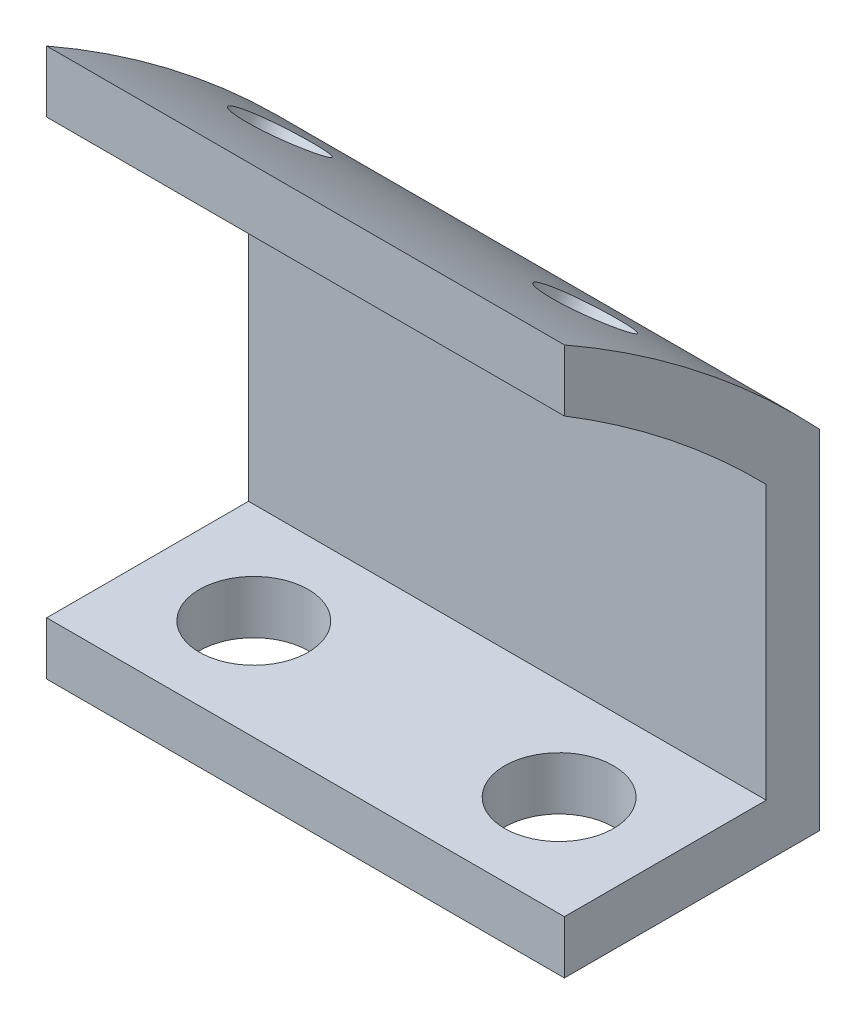
ISO-10303-21;
HEADER;
FILE_DESCRIPTION(('STEP AP214'),'2;1');
FILE_NAME('part.step','',(''),(''),'','','');
FILE_SCHEMA(('AUTOMOTIVE_DESIGN { 1 0 10303 214 1 1 1 1 }'));
ENDSEC;
DATA;
#1=APPLICATION_CONTEXT('core data for automotive mechanical design processes');
#2=APPLICATION_PROTOCOL_DEFINITION('international standard','automotive_design',2000,#1);
#3=PRODUCT_CONTEXT('',#1,'mechanical');
#4=PRODUCT('Part','Part','',(#3));
#5=PRODUCT_RELATED_PRODUCT_CATEGORY('part','',(#4));
#6=PRODUCT_DEFINITION_FORMATION('','',#4);
#7=PRODUCT_DEFINITION_CONTEXT('part definition',#1,'design');
#8=PRODUCT_DEFINITION('design','',#6,#7);
#9=PRODUCT_DEFINITION_SHAPE('','',#8);
#10=(LENGTH_UNIT() NAMED_UNIT(*) SI_UNIT(.MILLI.,.METRE.));
#11=(NAMED_UNIT(*) PLANE_ANGLE_UNIT() SI_UNIT($,.RADIAN.));
#12=(NAMED_UNIT(*) SI_UNIT($,.STERADIAN.) SOLID_ANGLE_UNIT());
#13=UNCERTAINTY_MEASURE_WITH_UNIT(LENGTH_MEASURE(1.E-05),#10,'distance_accuracy_value','');
#14=(GEOMETRIC_REPRESENTATION_CONTEXT(3) GLOBAL_UNCERTAINTY_ASSIGNED_CONTEXT((#13)) GLOBAL_UNIT_ASSIGNED_CONTEXT((#10,
#11,#12)) REPRESENTATION_CONTEXT('',''));
#15=CARTESIAN_POINT('',(0.,0.,0.));
#16=DIRECTION('',(0.,0.,1.));
#17=DIRECTION('',(1.,0.,0.));
#18=AXIS2_PLACEMENT_3D('',#15,#16,#17);
#19=CARTESIAN_POINT('',(19.5,15.,-29.85));
#20=DIRECTION('',(0.,1.,0.));
#21=DIRECTION('',(0.,0.,1.));
#22=AXIS2_PLACEMENT_3D('',#19,#20,#21);
#23=PLANE('',#22);
#24=CARTESIAN_POINT('',(4.,15.,-24.05));
#25=DIRECTION('',(0.,-1.,0.));
#26=DIRECTION('',(0.,0.,-1.));
#27=AXIS2_PLACEMENT_3D('',#24,#25,#26);
#28=CIRCLE('',#27,2.04999999999999);
#29=CARTESIAN_POINT('',(4.,15.,-26.1));
#30=VERTEX_POINT('',#29);
#31=EDGE_CURVE('E183',#30,#30,#28,.T.);
#32=ORIENTED_EDGE('',*,*,#31,.F.);
#33=EDGE_LOOP('',(#32));
#34=FACE_BOUND('',#33,.T.);
#35=DIRECTION('',(0.,0.,-1.));
#36=VECTOR('',#35,1.);
#37=CARTESIAN_POINT('',(0.,15.,-29.85));
#38=LINE('',#37,#36);
#39=CARTESIAN_POINT('',(0.,15.,-20.25));
#40=VERTEX_POINT('',#39);
#41=CARTESIAN_POINT('',(0.,15.,-29.85));
#42=VERTEX_POINT('',#41);
#43=EDGE_CURVE('E133',#40,#42,#38,.T.);
#44=ORIENTED_EDGE('',*,*,#43,.T.);
#45=DIRECTION('',(-1.,0.,0.));
#46=VECTOR('',#45,1.);
#47=CARTESIAN_POINT('',(19.5,15.,-29.85));
#48=LINE('',#47,#46);
#49=CARTESIAN_POINT('',(19.5,15.,-29.85));
#50=VERTEX_POINT('',#49);
#51=EDGE_CURVE('E11',#50,#42,#48,.T.);
#52=ORIENTED_EDGE('',*,*,#51,.F.);
#53=DIRECTION('',(0.,0.,-1.));
#54=VECTOR('',#53,1.);
#55=CARTESIAN_POINT('',(19.5,15.,-29.85));
#56=LINE('',#55,#54);
#57=CARTESIAN_POINT('',(19.5,15.,-20.25));
#58=VERTEX_POINT('',#57);
#59=EDGE_CURVE('E148',#58,#50,#56,.T.);
#60=ORIENTED_EDGE('',*,*,#59,.F.);
#61=DIRECTION('',(-1.,0.,0.));
#62=VECTOR('',#61,1.);
#63=CARTESIAN_POINT('',(19.5,15.,-20.25));
#64=LINE('',#63,#62);
#65=EDGE_CURVE('E129',#58,#40,#64,.T.);
#66=ORIENTED_EDGE('',*,*,#65,.T.);
#67=EDGE_LOOP('',(#44,#52,#60,#66));
#68=FACE_BOUND('',#67,.T.);
#69=CARTESIAN_POINT('',(15.5,15.,-24.05));
#70=DIRECTION('',(0.,-1.,0.));
#71=DIRECTION('',(0.,0.,-1.));
#72=AXIS2_PLACEMENT_3D('',#69,#70,#71);
#73=CIRCLE('',#72,2.04999999999999);
#74=CARTESIAN_POINT('',(15.5,15.,-26.1));
#75=VERTEX_POINT('',#74);
#76=EDGE_CURVE('E189',#75,#75,#73,.T.);
#77=ORIENTED_EDGE('',*,*,#76,.F.);
#78=EDGE_LOOP('',(#77));
#79=FACE_BOUND('',#78,.T.);
#80=ADVANCED_FACE('F37',(#34,#68,#79),#23,.F.);
#81=CARTESIAN_POINT('',(19.5,15.,-29.85));
#82=DIRECTION('',(0.,0.,1.));
#83=DIRECTION('',(1.,0.,0.));
#84=AXIS2_PLACEMENT_3D('',#81,#82,#83);
#85=PLANE('',#84);
#86=DIRECTION('',(0.,1.,0.));
#87=VECTOR('',#86,1.);
#88=CARTESIAN_POINT('',(0.,15.,-29.85));
#89=LINE('',#88,#87);
#90=CARTESIAN_POINT('',(0.,28.1065383852227,-29.85));
#91=VERTEX_POINT('',#90);
#92=EDGE_CURVE('E136',#42,#91,#89,.T.);
#93=ORIENTED_EDGE('',*,*,#92,.T.);
#94=DIRECTION('',(-1.,0.,0.));
#95=VECTOR('',#94,1.);
#96=CARTESIAN_POINT('',(19.5,28.1065383852227,-29.85));
#97=LINE('',#96,#95);
#98=CARTESIAN_POINT('',(19.5,28.1065383852227,-29.85));
#99=VERTEX_POINT('',#98);
#100=EDGE_CURVE('E45',#99,#91,#97,.T.);
#101=ORIENTED_EDGE('',*,*,#100,.F.);
#102=DIRECTION('',(0.,1.,0.));
#103=VECTOR('',#102,1.);
#104=CARTESIAN_POINT('',(19.5,15.,-29.85));
#105=LINE('',#104,#103);
#106=EDGE_CURVE('E96',#50,#99,#105,.T.);
#107=ORIENTED_EDGE('',*,*,#106,.F.);
#108=ORIENTED_EDGE('',*,*,#51,.T.);
#109=EDGE_LOOP('',(#93,#101,#107,#108));
#110=FACE_BOUND('',#109,.T.);
#111=ADVANCED_FACE('F243',(#110),#85,.F.);
#112=CARTESIAN_POINT('',(19.5,0.,0.));
#113=DIRECTION('',(-1.,0.,0.));
#114=DIRECTION('',(0.,0.,1.));
#115=AXIS2_PLACEMENT_3D('',#112,#113,#114);
#116=CYLINDRICAL_SURFACE('',#115,41.);
#117=CARTESIAN_POINT('',(4.,33.3900314513226,-23.7929779489599));
#118=CARTESIAN_POINT('',(3.91296920330301,33.3900294133815,-23.7929812381635));
#119=CARTESIAN_POINT('',(3.82587609288315,33.3857620041803,-23.7989730328684));
#120=CARTESIAN_POINT('',(3.65409075191891,33.3687801800026,-23.8227772272035));
#121=CARTESIAN_POINT('',(3.56940150135863,33.3560557204116,-23.8406036830781));
#122=CARTESIAN_POINT('',(3.40493733147452,33.3224693071459,-23.8875253411557));
#123=CARTESIAN_POINT('',(3.32515999729658,33.3016113897291,-23.9166149539257));
#124=CARTESIAN_POINT('',(3.17276484779084,33.2522727995411,-23.9851647554587));
#125=CARTESIAN_POINT('',(3.10014530966438,33.2237939671964,-24.024622440324));
#126=CARTESIAN_POINT('',(2.96405856421498,33.1598980307162,-24.1127376526163));
#127=CARTESIAN_POINT('',(2.9005964234765,33.12447711104,-24.1614002387666));
#128=CARTESIAN_POINT('',(2.78466884951612,33.0475978110635,-24.266448159755));
#129=CARTESIAN_POINT('',(2.73220385781202,33.0061391884725,-24.3228338045112));
#130=CARTESIAN_POINT('',(2.63974881672785,32.9182406202144,-24.4416629819393));
#131=CARTESIAN_POINT('',(2.59976227686443,32.8717992781028,-24.5041082123846));
#132=CARTESIAN_POINT('',(2.53342186665953,32.7751718292791,-24.6332012828259));
#133=CARTESIAN_POINT('',(2.50706792563399,32.7249857419848,-24.6998491010296));
#134=CARTESIAN_POINT('',(2.46875298891942,32.6222549758799,-24.8353720104876));
#135=CARTESIAN_POINT('',(2.45678505778417,32.5697114462684,-24.9042460120473));
#136=CARTESIAN_POINT('',(2.44756048177392,32.4637060253048,-25.0422715038729));
#137=CARTESIAN_POINT('',(2.45030375931664,32.4102441387974,-25.1114229926736));
#138=CARTESIAN_POINT('',(2.47041792427223,32.3039554330876,-25.248008832655));
#139=CARTESIAN_POINT('',(2.48778133652279,32.2511283033362,-25.3154440432066));
#140=CARTESIAN_POINT('',(2.53663131288563,32.1476232492503,-25.4467544756635));
#141=CARTESIAN_POINT('',(2.56811791741596,32.0969453310669,-25.5106296873802));
#142=CARTESIAN_POINT('',(2.64432904955598,31.9992370983848,-25.6330834939543));
#143=CARTESIAN_POINT('',(2.68905699645029,31.9522077300074,-25.6916607156157));
#144=CARTESIAN_POINT('',(2.79047863153094,31.8632407435978,-25.8019169044772));
#145=CARTESIAN_POINT('',(2.84717236597796,31.8213031452518,-25.8535958450068));
#146=CARTESIAN_POINT('',(2.97095854140618,31.7437926543832,-25.9487071539543));
#147=CARTESIAN_POINT('',(3.03805746732831,31.7082237610894,-25.9921343417239));
#148=CARTESIAN_POINT('',(3.1807264931688,31.6446018567446,-26.0695548956027));
#149=CARTESIAN_POINT('',(3.25629659471608,31.6165488471387,-26.1035482598979));
#150=CARTESIAN_POINT('',(3.41376658573379,31.5688527089169,-26.1612107101792));
#151=CARTESIAN_POINT('',(3.49566658143527,31.5492097214778,-26.1848796228514));
#152=CARTESIAN_POINT('',(3.6634698132238,31.5189675345562,-26.2212747639418));
#153=CARTESIAN_POINT('',(3.7493730320611,31.5083682961084,-26.2340010395067));
#154=CARTESIAN_POINT('',(3.92268726695,31.4965612153072,-26.2481755279645));
#155=CARTESIAN_POINT('',(4.01009731666591,31.4953475631919,-26.2496307177611));
#156=CARTESIAN_POINT('',(4.18399400371782,31.5023357948913,-26.2412436465184));
#157=CARTESIAN_POINT('',(4.27048064277866,31.5105376611156,-26.2314014065851));
#158=CARTESIAN_POINT('',(4.44005009710697,31.5360869315477,-26.2006796838525));
#159=CARTESIAN_POINT('',(4.52313388696332,31.5534316971737,-26.1798033854064));
#160=CARTESIAN_POINT('',(4.68356915630723,31.5967059182592,-26.127558612324));
#161=CARTESIAN_POINT('',(4.76092061707566,31.6226354017508,-26.0961901034269));
#162=CARTESIAN_POINT('',(4.90773727871508,31.6822660149566,-26.0237624734246));
#163=CARTESIAN_POINT('',(4.97719857774383,31.7159709650388,-25.9826985883968));
#164=CARTESIAN_POINT('',(5.10622395254847,31.7900822617426,-25.8919696376587));
#165=CARTESIAN_POINT('',(5.16578799051799,31.8304886339616,-25.8423045390941));
#166=CARTESIAN_POINT('',(5.27335838962048,31.9167690194773,-25.7356669376732));
#167=CARTESIAN_POINT('',(5.3213588973965,31.9626457843473,-25.6786907562816));
#168=CARTESIAN_POINT('',(5.40439966932494,32.0584472444931,-25.5589872492174));
#169=CARTESIAN_POINT('',(5.4394399717235,32.1083719278229,-25.4962599405173));
#170=CARTESIAN_POINT('',(5.49555540384068,32.2107564384235,-25.3667887904608));
#171=CARTESIAN_POINT('',(5.51663430955453,32.2632155761049,-25.3000460404509));
#172=CARTESIAN_POINT('',(5.54424097096258,32.3691391165565,-25.16438427321));
#173=CARTESIAN_POINT('',(5.5507687623249,32.4226035168621,-25.095465261314));
#174=CARTESIAN_POINT('',(5.54908747118956,32.5289677089931,-24.9574407012299));
#175=CARTESIAN_POINT('',(5.54088759258396,32.5818678326754,-24.8883352964726));
#176=CARTESIAN_POINT('',(5.51000269645625,32.6856565041717,-24.751872871296));
#177=CARTESIAN_POINT('',(5.48731765063966,32.7365450480561,-24.6845158542923));
#178=CARTESIAN_POINT('',(5.42810796094028,32.8349234790265,-24.5535031473083));
#179=CARTESIAN_POINT('',(5.39158311715826,32.8824133170105,-24.4898475108054));
#180=CARTESIAN_POINT('',(5.30573290441397,32.9727312254065,-24.3681092342418));
#181=CARTESIAN_POINT('',(5.25640797515215,33.0155594558795,-24.3100264028415));
#182=CARTESIAN_POINT('',(5.14632724556696,33.0954685273542,-24.2011267375501));
#183=CARTESIAN_POINT('',(5.08556554023828,33.1325463812183,-24.1503136811309));
#184=CARTESIAN_POINT('',(4.95433037855168,33.1999976084451,-24.0575031939883));
#185=CARTESIAN_POINT('',(4.88385452628499,33.2303693229744,-24.0155079445671));
#186=CARTESIAN_POINT('',(4.73515489943093,33.2836606647112,-23.9415959589103));
#187=CARTESIAN_POINT('',(4.65692535040787,33.3065746826919,-23.9096868093444));
#188=CARTESIAN_POINT('',(4.49503966568908,33.344336714473,-23.856996244492));
#189=CARTESIAN_POINT('',(4.41139011417552,33.3591943168685,-23.8362016013515));
#190=CARTESIAN_POINT('',(4.27267916038253,33.3765617698409,-23.8118719944715));
#191=CARTESIAN_POINT('',(4.21851750278245,33.3816073173551,-23.8047963051797));
#192=CARTESIAN_POINT('',(4.10957879905299,33.3883427989259,-23.7953482479654));
#193=CARTESIAN_POINT('',(4.05480175321623,33.390032734578,-23.7929758778065));
#194=CARTESIAN_POINT('',(4.,33.3900314513226,-23.7929779489599));
#195=B_SPLINE_CURVE_WITH_KNOTS('',3,(#117,#118,#119,#120,#121,#122,#123,#124,#125,#126,#127,
#128,#129,#130,#131,#132,#133,#134,#135,#136,#137,#138,#139,#140,#141,#142,#143,#144,#145,#146,
#147,#148,#149,#150,#151,#152,#153,#154,#155,#156,#157,#158,#159,#160,#161,#162,#163,#164,#165,
#166,#167,#168,#169,#170,#171,#172,#173,#174,#175,#176,#177,#178,#179,#180,#181,#182,#183,#184,
#185,#186,#187,#188,#189,#190,#191,#192,#193,#194),.UNSPECIFIED.,.T.,.F.,(4,2,2,2,2,2,2,2,2,2,2,
2,2,2,2,2,2,2,2,2,2,2,2,2,2,2,2,2,2,2,2,2,2,2,2,2,2,2,4),(0.,0.260892351985128,
0.522095126306813,0.783168442430561,1.04417876699429,1.3053329535601,1.56649762303793,
1.82773567801623,2.08897237847995,2.35008308704715,2.6111924186,2.8721683279719,
3.13314498421482,3.3941890907942,3.65523420660915,3.91644267518353,4.17765119398582,
4.43886409745628,4.70007587547379,4.96112594811481,5.2221755330573,5.48314982199079,
5.74412496310756,6.00522860488983,6.26633324403453,6.52756977562874,6.78880553629615,
7.04997061433431,7.3111350521961,7.57213633505833,7.83313812774686,8.09414369043603,
8.35514028841377,8.61627201495145,8.87746826296108,9.13886051536132,9.39994097690472,
9.56422035421019,9.72849965340205),.UNSPECIFIED.);
#196=CARTESIAN_POINT('',(4.,33.3900314513226,-23.7929779489599));
#197=VERTEX_POINT('',#196);
#198=EDGE_CURVE('E302',#197,#197,#195,.T.);
#199=ORIENTED_EDGE('',*,*,#198,.T.);
#200=EDGE_LOOP('',(#199));
#201=FACE_BOUND('',#200,.T.);
#202=CARTESIAN_POINT('',(15.5,33.3900314513226,-23.7929779489599));
#203=CARTESIAN_POINT('',(15.412969203303,33.3900294133815,-23.7929812381635));
#204=CARTESIAN_POINT('',(15.3258760928831,33.3857620041803,-23.7989730328684));
#205=CARTESIAN_POINT('',(15.1540907519189,33.3687801800026,-23.8227772272035));
#206=CARTESIAN_POINT('',(15.0694015013586,33.3560557204116,-23.8406036830781));
#207=CARTESIAN_POINT('',(14.9049373314745,33.3224693071459,-23.8875253411557));
#208=CARTESIAN_POINT('',(14.8251599972966,33.3016113897291,-23.9166149539257));
#209=CARTESIAN_POINT('',(14.6727648477908,33.2522727995411,-23.9851647554587));
#210=CARTESIAN_POINT('',(14.6001453096644,33.2237939671964,-24.024622440324));
#211=CARTESIAN_POINT('',(14.464058564215,33.1598980307162,-24.1127376526163));
#212=CARTESIAN_POINT('',(14.4005964234765,33.12447711104,-24.1614002387666));
#213=CARTESIAN_POINT('',(14.2846688495161,33.0475978110635,-24.266448159755));
#214=CARTESIAN_POINT('',(14.232203857812,33.0061391884725,-24.3228338045112));
#215=CARTESIAN_POINT('',(14.1397488167278,32.9182406202144,-24.4416629819393));
#216=CARTESIAN_POINT('',(14.0997622768644,32.8717992781028,-24.5041082123846));
#217=CARTESIAN_POINT('',(14.0334218666595,32.7751718292791,-24.6332012828259));
#218=CARTESIAN_POINT('',(14.007067925634,32.7249857419848,-24.6998491010296));
#219=CARTESIAN_POINT('',(13.9687529889194,32.6222549758799,-24.8353720104876));
#220=CARTESIAN_POINT('',(13.9567850577842,32.5697114462684,-24.9042460120473));
#221=CARTESIAN_POINT('',(13.9475604817739,32.4637060253048,-25.0422715038729));
#222=CARTESIAN_POINT('',(13.9503037593166,32.4102441387974,-25.1114229926736));
#223=CARTESIAN_POINT('',(13.9704179242722,32.3039554330876,-25.248008832655));
#224=CARTESIAN_POINT('',(13.9877813365228,32.2511283033362,-25.3154440432066));
#225=CARTESIAN_POINT('',(14.0366313128856,32.1476232492503,-25.4467544756635));
#226=CARTESIAN_POINT('',(14.068117917416,32.0969453310669,-25.5106296873802));
#227=CARTESIAN_POINT('',(14.144329049556,31.9992370983848,-25.6330834939543));
#228=CARTESIAN_POINT('',(14.1890569964503,31.9522077300074,-25.6916607156157));
#229=CARTESIAN_POINT('',(14.2904786315309,31.8632407435978,-25.8019169044772));
#230=CARTESIAN_POINT('',(14.347172365978,31.8213031452518,-25.8535958450068));
#231=CARTESIAN_POINT('',(14.4709585414062,31.7437926543832,-25.9487071539543));
#232=CARTESIAN_POINT('',(14.5380574673283,31.7082237610894,-25.9921343417239));
#233=CARTESIAN_POINT('',(14.6807264931688,31.6446018567446,-26.0695548956027));
#234=CARTESIAN_POINT('',(14.7562965947161,31.6165488471387,-26.1035482598979));
#235=CARTESIAN_POINT('',(14.9137665857338,31.5688527089169,-26.1612107101792));
#236=CARTESIAN_POINT('',(14.9956665814353,31.5492097214778,-26.1848796228514));
#237=CARTESIAN_POINT('',(15.1634698132238,31.5189675345562,-26.2212747639418));
#238=CARTESIAN_POINT('',(15.2493730320611,31.5083682961084,-26.2340010395067));
#239=CARTESIAN_POINT('',(15.42268726695,31.4965612153072,-26.2481755279645));
#240=CARTESIAN_POINT('',(15.5100973166659,31.4953475631919,-26.2496307177611));
#241=CARTESIAN_POINT('',(15.6839940037178,31.5023357948913,-26.2412436465184));
#242=CARTESIAN_POINT('',(15.7704806427787,31.5105376611156,-26.2314014065851));
#243=CARTESIAN_POINT('',(15.940050097107,31.5360869315477,-26.2006796838525));
#244=CARTESIAN_POINT('',(16.0231338869633,31.5534316971737,-26.1798033854064));
#245=CARTESIAN_POINT('',(16.1835691563072,31.5967059182592,-26.127558612324));
#246=CARTESIAN_POINT('',(16.2609206170757,31.6226354017508,-26.0961901034269));
#247=CARTESIAN_POINT('',(16.4077372787151,31.6822660149566,-26.0237624734246));
#248=CARTESIAN_POINT('',(16.4771985777438,31.7159709650388,-25.9826985883968));
#249=CARTESIAN_POINT('',(16.6062239525485,31.7900822617425,-25.8919696376587));
#250=CARTESIAN_POINT('',(16.665787990518,31.8304886339616,-25.8423045390941));
#251=CARTESIAN_POINT('',(16.7733583896205,31.9167690194773,-25.7356669376732));
#252=CARTESIAN_POINT('',(16.8213588973965,31.9626457843473,-25.6786907562816));
#253=CARTESIAN_POINT('',(16.9043996693249,32.0584472444931,-25.5589872492174));
#254=CARTESIAN_POINT('',(16.9394399717235,32.1083719278229,-25.4962599405173));
#255=CARTESIAN_POINT('',(16.9955554038407,32.2107564384235,-25.3667887904608));
#256=CARTESIAN_POINT('',(17.0166343095545,32.2632155761049,-25.3000460404509));
#257=CARTESIAN_POINT('',(17.0442409709626,32.3691391165565,-25.16438427321));
#258=CARTESIAN_POINT('',(17.0507687623249,32.4226035168621,-25.095465261314));
#259=CARTESIAN_POINT('',(17.0490874711896,32.5289677089931,-24.9574407012299));
#260=CARTESIAN_POINT('',(17.040887592584,32.5818678326754,-24.8883352964726));
#261=CARTESIAN_POINT('',(17.0100026964562,32.6856565041717,-24.751872871296));
#262=CARTESIAN_POINT('',(16.9873176506397,32.7365450480561,-24.6845158542923));
#263=CARTESIAN_POINT('',(16.9281079609403,32.8349234790265,-24.5535031473083));
#264=CARTESIAN_POINT('',(16.8915831171583,32.8824133170105,-24.4898475108054));
#265=CARTESIAN_POINT('',(16.805732904414,32.9727312254065,-24.3681092342418));
#266=CARTESIAN_POINT('',(16.7564079751522,33.0155594558795,-24.3100264028415));
#267=CARTESIAN_POINT('',(16.646327245567,33.0954685273542,-24.2011267375501));
#268=CARTESIAN_POINT('',(16.5855655402383,33.1325463812183,-24.1503136811309));
#269=CARTESIAN_POINT('',(16.4543303785517,33.1999976084451,-24.0575031939883));
#270=CARTESIAN_POINT('',(16.383854526285,33.2303693229744,-24.0155079445671));
#271=CARTESIAN_POINT('',(16.2351548994309,33.2836606647112,-23.9415959589103));
#272=CARTESIAN_POINT('',(16.1569253504079,33.3065746826919,-23.9096868093444));
#273=CARTESIAN_POINT('',(15.9950396656891,33.344336714473,-23.856996244492));
#274=CARTESIAN_POINT('',(15.9113901141755,33.3591943168685,-23.8362016013515));
#275=CARTESIAN_POINT('',(15.7726791603825,33.376561769841,-23.8118719944715));
#276=CARTESIAN_POINT('',(15.7185175027825,33.3816073173551,-23.8047963051797));
#277=CARTESIAN_POINT('',(15.609578799053,33.3883427989259,-23.7953482479654));
#278=CARTESIAN_POINT('',(15.5548017532162,33.390032734578,-23.7929758778065));
#279=CARTESIAN_POINT('',(15.5,33.3900314513226,-23.7929779489599));
#280=B_SPLINE_CURVE_WITH_KNOTS('',3,(#202,#203,#204,#205,#206,#207,#208,#209,#210,#211,#212,
#213,#214,#215,#216,#217,#218,#219,#220,#221,#222,#223,#224,#225,#226,#227,#228,#229,#230,#231,
#232,#233,#234,#235,#236,#237,#238,#239,#240,#241,#242,#243,#244,#245,#246,#247,#248,#249,#250,
#251,#252,#253,#254,#255,#256,#257,#258,#259,#260,#261,#262,#263,#264,#265,#266,#267,#268,#269,
#270,#271,#272,#273,#274,#275,#276,#277,#278,#279),.UNSPECIFIED.,.T.,.F.,(4,2,2,2,2,2,2,2,2,2,2,
2,2,2,2,2,2,2,2,2,2,2,2,2,2,2,2,2,2,2,2,2,2,2,2,2,2,2,4),(0.,0.260892351985127,
0.522095126306814,0.783168442430561,1.04417876699429,1.3053329535601,1.56649762303793,
1.82773567801623,2.08897237847995,2.35008308704715,2.6111924186,2.8721683279719,
3.13314498421482,3.3941890907942,3.65523420660914,3.91644267518353,4.17765119398581,
4.43886409745628,4.70007587547379,4.96112594811481,5.2221755330573,5.48314982199079,
5.74412496310756,6.00522860488982,6.26633324403453,6.52756977562873,6.78880553629615,
7.04997061433431,7.3111350521961,7.57213633505833,7.83313812774686,8.09414369043603,
8.35514028841377,8.61627201495145,8.87746826296108,9.13886051536132,9.39994097690471,
9.56422035421018,9.72849965340204),.UNSPECIFIED.);
#281=CARTESIAN_POINT('',(15.5,33.3900314513226,-23.7929779489599));
#282=VERTEX_POINT('',#281);
#283=EDGE_CURVE('E192',#282,#282,#280,.T.);
#284=ORIENTED_EDGE('',*,*,#283,.T.);
#285=EDGE_LOOP('',(#284));
#286=FACE_BOUND('',#285,.T.);
#287=CARTESIAN_POINT('',(0.,0.,0.));
#288=DIRECTION('',(1.,0.,0.));
#289=DIRECTION('',(0.,0.,-1.));
#290=AXIS2_PLACEMENT_3D('',#287,#288,#289);
#291=CIRCLE('',#290,41.);
#292=CARTESIAN_POINT('',(0.,35.6502103780609,-20.25));
#293=VERTEX_POINT('',#292);
#294=EDGE_CURVE('E139',#91,#293,#291,.T.);
#295=ORIENTED_EDGE('',*,*,#294,.T.);
#296=DIRECTION('',(-1.,0.,0.));
#297=VECTOR('',#296,1.);
#298=CARTESIAN_POINT('',(19.5,35.6502103780609,-20.25));
#299=LINE('',#298,#297);
#300=CARTESIAN_POINT('',(19.5,35.6502103780609,-20.25));
#301=VERTEX_POINT('',#300);
#302=EDGE_CURVE('E155',#301,#293,#299,.T.);
#303=ORIENTED_EDGE('',*,*,#302,.F.);
#304=CARTESIAN_POINT('',(19.5,0.,0.));
#305=DIRECTION('',(1.,0.,0.));
#306=DIRECTION('',(0.,0.,-1.));
#307=AXIS2_PLACEMENT_3D('',#304,#305,#306);
#308=CIRCLE('',#307,41.);
#309=EDGE_CURVE('E163',#99,#301,#308,.T.);
#310=ORIENTED_EDGE('',*,*,#309,.F.);
#311=ORIENTED_EDGE('',*,*,#100,.T.);
#312=EDGE_LOOP('',(#295,#303,#310,#311));
#313=FACE_BOUND('',#312,.T.);
#314=ADVANCED_FACE('F161',(#201,#286,#313),#116,.T.);
#315=CARTESIAN_POINT('',(19.5,33.3307290649335,-20.25));
#316=DIRECTION('',(0.,0.,-1.));
#317=DIRECTION('',(-1.,0.,0.));
#318=AXIS2_PLACEMENT_3D('',#315,#316,#317);
#319=PLANE('',#318);
#320=DIRECTION('',(0.,-1.,0.));
#321=VECTOR('',#320,1.);
#322=CARTESIAN_POINT('',(0.,33.3307290649335,-20.25));
#323=LINE('',#322,#321);
#324=CARTESIAN_POINT('',(0.,33.3307290649335,-20.25));
#325=VERTEX_POINT('',#324);
#326=EDGE_CURVE('E141',#293,#325,#323,.T.);
#327=ORIENTED_EDGE('',*,*,#326,.T.);
#328=DIRECTION('',(-1.,0.,0.));
#329=VECTOR('',#328,1.);
#330=CARTESIAN_POINT('',(19.5,33.3307290649335,-20.25));
#331=LINE('',#330,#329);
#332=CARTESIAN_POINT('',(19.5,33.3307290649335,-20.25));
#333=VERTEX_POINT('',#332);
#334=EDGE_CURVE('E152',#333,#325,#331,.T.);
#335=ORIENTED_EDGE('',*,*,#334,.F.);
#336=DIRECTION('',(0.,-1.,0.));
#337=VECTOR('',#336,1.);
#338=CARTESIAN_POINT('',(19.5,33.3307290649335,-20.25));
#339=LINE('',#338,#337);
#340=EDGE_CURVE('E175',#301,#333,#339,.T.);
#341=ORIENTED_EDGE('',*,*,#340,.F.);
#342=ORIENTED_EDGE('',*,*,#302,.T.);
#343=EDGE_LOOP('',(#327,#335,#341,#342));
#344=FACE_BOUND('',#343,.T.);
#345=ADVANCED_FACE('F171',(#344),#319,.F.);
#346=CARTESIAN_POINT('',(19.5,0.,0.));
#347=DIRECTION('',(-1.,0.,0.));
#348=DIRECTION('',(0.,0.,1.));
#349=AXIS2_PLACEMENT_3D('',#346,#347,#348);
#350=CYLINDRICAL_SURFACE('',#349,39.);
#351=CARTESIAN_POINT('',(4.,31.805100242463,-22.5706800643419));
#352=CARTESIAN_POINT('',(4.08702728417605,31.8050982212125,-22.570683364809));
#353=CARTESIAN_POINT('',(4.17411679621655,31.8008425380099,-22.5766834563212));
#354=CARTESIAN_POINT('',(4.34589479849875,31.7839064676017,-22.6005197987051));
#355=CARTESIAN_POINT('',(4.4305803125819,31.7712160751715,-22.6183701062347));
#356=CARTESIAN_POINT('',(4.59503699032177,31.737716510908,-22.6653519336039));
#357=CARTESIAN_POINT('',(4.67481057816223,31.7169113817369,-22.6944778360267));
#358=CARTESIAN_POINT('',(4.82719897723176,31.6676913667795,-22.7631082681421));
#359=CARTESIAN_POINT('',(4.89981550568992,31.6392783125113,-22.8026102998604));
#360=CARTESIAN_POINT('',(5.03590078312733,31.5755182499233,-22.8908191573435));
#361=CARTESIAN_POINT('',(5.09936403430205,31.5401671041652,-22.9395314749013));
#362=CARTESIAN_POINT('',(5.21529463564883,31.4634246268259,-23.0446769993265));
#363=CARTESIAN_POINT('',(5.2677615433091,31.4220330522812,-23.1011105167574));
#364=CARTESIAN_POINT('',(5.36022274318823,31.3342568417455,-23.220030215442));
#365=CARTESIAN_POINT('',(5.40021313178523,31.287870649145,-23.2825182830299));
#366=CARTESIAN_POINT('',(5.46656094611011,31.1913365107634,-23.4116855614604));
#367=CARTESIAN_POINT('',(5.49291844708145,31.1411885857461,-23.4783647491688));
#368=CARTESIAN_POINT('',(5.53123881032405,31.0385154748592,-23.6139318920207));
#369=CARTESIAN_POINT('',(5.54320933983542,30.9859915707198,-23.6828186505697));
#370=CARTESIAN_POINT('',(5.55243960586396,30.8800024199099,-23.8208526554611));
#371=CARTESIAN_POINT('',(5.54969942532626,30.8265371785487,-23.8899999003326));
#372=CARTESIAN_POINT('',(5.52959246142388,30.7202222787303,-24.0265567404331));
#373=CARTESIAN_POINT('',(5.51223393948947,30.6673722896679,-24.0939672949664));
#374=CARTESIAN_POINT('',(5.46339583195328,30.5638018744504,-24.225214304936));
#375=CARTESIAN_POINT('',(5.43191620328462,30.5130814547905,-24.2890507494712));
#376=CARTESIAN_POINT('',(5.35572001746304,30.4152719934474,-24.4114189206587));
#377=CARTESIAN_POINT('',(5.31099968339096,30.3681839927516,-24.4699491274726));
#378=CARTESIAN_POINT('',(5.2095943105597,30.2790913450334,-24.5801068776615));
#379=CARTESIAN_POINT('',(5.15290922017268,30.237086719947,-24.6317343912498));
#380=CARTESIAN_POINT('',(5.02913668112986,30.1594383531139,-24.7267477482326));
#381=CARTESIAN_POINT('',(4.9620420655725,30.123799030486,-24.7701278672005));
#382=CARTESIAN_POINT('',(4.81938027770617,30.0600434540848,-24.8474607864212));
#383=CARTESIAN_POINT('',(4.74381310369267,30.0319272018249,-24.8814135847775));
#384=CARTESIAN_POINT('',(4.58634707584874,29.9841186061024,-24.9390063811465));
#385=CARTESIAN_POINT('',(4.50444810291995,29.9644264211382,-24.9626461851207));
#386=CARTESIAN_POINT('',(4.33664518464625,29.9341053706225,-24.9989979952141));
#387=CARTESIAN_POINT('',(4.25074125836159,29.923476461942,-25.0117100533348));
#388=CARTESIAN_POINT('',(4.07742988192292,29.9116331338749,-25.0258724187831));
#389=CARTESIAN_POINT('',(3.99002350062932,29.9104122784461,-25.0273304250004));
#390=CARTESIAN_POINT('',(3.81613305273632,29.9174080323653,-25.0189673088898));
#391=CARTESIAN_POINT('',(3.72964898422815,29.9256246221784,-25.0091462099091));
#392=CARTESIAN_POINT('',(3.56008618390292,29.9512226874956,-24.9784838224968));
#393=CARTESIAN_POINT('',(3.47700637453368,29.968601238427,-24.9576460506711));
#394=CARTESIAN_POINT('',(3.31657728847705,30.0119577767272,-24.9054920398997));
#395=CARTESIAN_POINT('',(3.23922803253879,30.037935795231,-24.8741757630159));
#396=CARTESIAN_POINT('',(3.09240955017286,30.097673752955,-24.8018593470821));
#397=CARTESIAN_POINT('',(3.02294463407892,30.1314379185407,-24.7608539484218));
#398=CARTESIAN_POINT('',(2.89391000753607,30.2056701029713,-24.6702435065861));
#399=CARTESIAN_POINT('',(2.83434033845407,30.2461381498403,-24.6206384274615));
#400=CARTESIAN_POINT('',(2.72675360383105,30.3325395171777,-24.514113145198));
#401=CARTESIAN_POINT('',(2.67874300820725,30.3784758770086,-24.4571888725308));
#402=CARTESIAN_POINT('',(2.59568148602336,30.4743855883799,-24.3375777677235));
#403=CARTESIAN_POINT('',(2.56063051865639,30.5243589272081,-24.2748909537292));
#404=CARTESIAN_POINT('',(2.50449456308037,30.6268227713879,-24.1454867489413));
#405=CARTESIAN_POINT('',(2.48340540611592,30.6793125203584,-24.0787705677453));
#406=CARTESIAN_POINT('',(2.4557780544118,30.7852769405705,-23.9431436215058));
#407=CARTESIAN_POINT('',(2.44923981748865,30.8387516089564,-23.874232862825));
#408=CARTESIAN_POINT('',(2.45090037174244,30.9451111024715,-23.7362104081491));
#409=CARTESIAN_POINT('',(2.45908899385373,30.9979963092605,-23.6670988836822));
#410=CARTESIAN_POINT('',(2.48994985115127,31.1017349433361,-23.5306063397247));
#411=CARTESIAN_POINT('',(2.51262211450705,31.152588366671,-23.4632253236002));
#412=CARTESIAN_POINT('',(2.57180484463198,31.250880243269,-23.33214950606));
#413=CARTESIAN_POINT('',(2.6083155003205,31.2983186499004,-23.2684547549823));
#414=CARTESIAN_POINT('',(2.69413627146021,31.3885234987259,-23.1466270766459));
#415=CARTESIAN_POINT('',(2.74344595383212,31.4312900989299,-23.0884939612899));
#416=CARTESIAN_POINT('',(2.85349936595751,31.5110756854516,-22.9794839569674));
#417=CARTESIAN_POINT('',(2.9142497456591,31.5480913060391,-22.9286113185636));
#418=CARTESIAN_POINT('',(3.04546392570029,31.6154221577554,-22.8356822618544));
#419=CARTESIAN_POINT('',(3.1159301209145,31.6457357320696,-22.7936280236802));
#420=CARTESIAN_POINT('',(3.26461498148949,31.6989228389218,-22.7196033550816));
#421=CARTESIAN_POINT('',(3.34283964752157,31.7217905530996,-22.6876408111194));
#422=CARTESIAN_POINT('',(3.50471871673278,31.759476754968,-22.6348558213484));
#423=CARTESIAN_POINT('',(3.58836653796922,31.7743048027797,-22.6140201448148));
#424=CARTESIAN_POINT('',(3.72711592318868,31.7916456768789,-22.5896301216841));
#425=CARTESIAN_POINT('',(3.78131766795302,31.796685598113,-22.5825335005376));
#426=CARTESIAN_POINT('',(3.89033803776511,31.803413516902,-22.5730574331578));
#427=CARTESIAN_POINT('',(3.94515666248731,31.8051015162259,-22.5706779844351));
#428=CARTESIAN_POINT('',(4.,31.805100242463,-22.5706800643419));
#429=B_SPLINE_CURVE_WITH_KNOTS('',3,(#351,#352,#353,#354,#355,#356,#357,#358,#359,#360,#361,
#362,#363,#364,#365,#366,#367,#368,#369,#370,#371,#372,#373,#374,#375,#376,#377,#378,#379,#380,
#381,#382,#383,#384,#385,#386,#387,#388,#389,#390,#391,#392,#393,#394,#395,#396,#397,#398,#399,
#400,#401,#402,#403,#404,#405,#406,#407,#408,#409,#410,#411,#412,#413,#414,#415,#416,#417,#418,
#419,#420,#421,#422,#423,#424,#425,#426,#427,#428),.UNSPECIFIED.,.T.,.F.,(4,2,2,2,2,2,2,2,2,2,2,
2,2,2,2,2,2,2,2,2,2,2,2,2,2,2,2,2,2,2,2,2,2,2,2,2,2,2,4),(0.,0.26088166133431,0.522073333247767,
0.783135048536894,1.04413397271112,1.30528901563148,1.5664545658632,1.82770174715838,
2.0889474865474,2.35005393857778,2.61115891838259,2.87211643589513,3.13307474928708,
3.39410757302899,3.655141523149,3.91635599786763,4.17757052513841,4.43878996693616,
4.70000816567388,4.96104764935858,5.22208659270399,5.48304226069397,5.7439988735039,
6.00509746988541,6.26619715775768,6.52744265198643,6.78868732360624,7.04985395685783,
7.31101983297991,7.57200544029362,7.83299155520484,8.09398123318205,8.35496208123062,
8.61609509621549,8.87729259395868,9.13869371010357,9.39978330363493,9.56418724533324,
9.7285911002724),.UNSPECIFIED.);
#430=CARTESIAN_POINT('',(4.,31.805100242463,-22.5706800643419));
#431=VERTEX_POINT('',#430);
#432=EDGE_CURVE('E299',#431,#431,#429,.T.);
#433=ORIENTED_EDGE('',*,*,#432,.T.);
#434=EDGE_LOOP('',(#433));
#435=FACE_BOUND('',#434,.T.);
#436=CARTESIAN_POINT('',(15.5,31.805100242463,-22.5706800643419));
#437=CARTESIAN_POINT('',(15.5870272841761,31.8050982212125,-22.570683364809));
#438=CARTESIAN_POINT('',(15.6741167962166,31.8008425380099,-22.5766834563212));
#439=CARTESIAN_POINT('',(15.8458947984987,31.7839064676017,-22.6005197987051));
#440=CARTESIAN_POINT('',(15.9305803125819,31.7712160751715,-22.6183701062347));
#441=CARTESIAN_POINT('',(16.0950369903218,31.737716510908,-22.6653519336039));
#442=CARTESIAN_POINT('',(16.1748105781622,31.7169113817369,-22.6944778360267));
#443=CARTESIAN_POINT('',(16.3271989772318,31.6676913667795,-22.7631082681421));
#444=CARTESIAN_POINT('',(16.3998155056899,31.6392783125113,-22.8026102998604));
#445=CARTESIAN_POINT('',(16.5359007831273,31.5755182499233,-22.8908191573435));
#446=CARTESIAN_POINT('',(16.599364034302,31.5401671041652,-22.9395314749013));
#447=CARTESIAN_POINT('',(16.7152946356488,31.4634246268259,-23.0446769993265));
#448=CARTESIAN_POINT('',(16.7677615433091,31.4220330522812,-23.1011105167574));
#449=CARTESIAN_POINT('',(16.8602227431882,31.3342568417455,-23.220030215442));
#450=CARTESIAN_POINT('',(16.9002131317852,31.287870649145,-23.2825182830299));
#451=CARTESIAN_POINT('',(16.9665609461101,31.1913365107634,-23.4116855614604));
#452=CARTESIAN_POINT('',(16.9929184470814,31.1411885857461,-23.4783647491688));
#453=CARTESIAN_POINT('',(17.031238810324,31.0385154748592,-23.6139318920207));
#454=CARTESIAN_POINT('',(17.0432093398354,30.9859915707198,-23.6828186505697));
#455=CARTESIAN_POINT('',(17.052439605864,30.8800024199099,-23.8208526554611));
#456=CARTESIAN_POINT('',(17.0496994253263,30.8265371785487,-23.8899999003326));
#457=CARTESIAN_POINT('',(17.0295924614239,30.7202222787303,-24.0265567404331));
#458=CARTESIAN_POINT('',(17.0122339394895,30.6673722896679,-24.0939672949664));
#459=CARTESIAN_POINT('',(16.9633958319533,30.5638018744504,-24.225214304936));
#460=CARTESIAN_POINT('',(16.9319162032846,30.5130814547904,-24.2890507494712));
#461=CARTESIAN_POINT('',(16.855720017463,30.4152719934474,-24.4114189206587));
#462=CARTESIAN_POINT('',(16.8109996833909,30.3681839927516,-24.4699491274726));
#463=CARTESIAN_POINT('',(16.7095943105597,30.2790913450334,-24.5801068776615));
#464=CARTESIAN_POINT('',(16.6529092201727,30.237086719947,-24.6317343912498));
#465=CARTESIAN_POINT('',(16.5291366811299,30.1594383531139,-24.7267477482327));
#466=CARTESIAN_POINT('',(16.4620420655725,30.123799030486,-24.7701278672005));
#467=CARTESIAN_POINT('',(16.3193802777062,30.0600434540848,-24.8474607864212));
#468=CARTESIAN_POINT('',(16.2438131036927,30.0319272018249,-24.8814135847775));
#469=CARTESIAN_POINT('',(16.0863470758487,29.9841186061024,-24.9390063811465));
#470=CARTESIAN_POINT('',(16.0044481029199,29.9644264211382,-24.9626461851207));
#471=CARTESIAN_POINT('',(15.8366451846462,29.9341053706225,-24.9989979952141));
#472=CARTESIAN_POINT('',(15.7507412583616,29.923476461942,-25.0117100533348));
#473=CARTESIAN_POINT('',(15.5774298819229,29.9116331338749,-25.0258724187831));
#474=CARTESIAN_POINT('',(15.4900235006293,29.9104122784461,-25.0273304250004));
#475=CARTESIAN_POINT('',(15.3161330527363,29.9174080323653,-25.0189673088898));
#476=CARTESIAN_POINT('',(15.2296489842281,29.9256246221784,-25.0091462099091));
#477=CARTESIAN_POINT('',(15.0600861839029,29.9512226874956,-24.9784838224968));
#478=CARTESIAN_POINT('',(14.9770063745337,29.968601238427,-24.9576460506711));
#479=CARTESIAN_POINT('',(14.816577288477,30.0119577767272,-24.9054920398997));
#480=CARTESIAN_POINT('',(14.7392280325388,30.037935795231,-24.8741757630158));
#481=CARTESIAN_POINT('',(14.5924095501729,30.097673752955,-24.8018593470821));
#482=CARTESIAN_POINT('',(14.5229446340789,30.1314379185407,-24.7608539484218));
#483=CARTESIAN_POINT('',(14.3939100075361,30.2056701029713,-24.6702435065861));
#484=CARTESIAN_POINT('',(14.3343403384541,30.2461381498403,-24.6206384274615));
#485=CARTESIAN_POINT('',(14.2267536038311,30.3325395171777,-24.514113145198));
#486=CARTESIAN_POINT('',(14.1787430082072,30.3784758770086,-24.4571888725308));
#487=CARTESIAN_POINT('',(14.0956814860234,30.4743855883799,-24.3375777677235));
#488=CARTESIAN_POINT('',(14.0606305186564,30.5243589272081,-24.2748909537292));
#489=CARTESIAN_POINT('',(14.0044945630804,30.6268227713879,-24.1454867489413));
#490=CARTESIAN_POINT('',(13.9834054061159,30.6793125203584,-24.0787705677453));
#491=CARTESIAN_POINT('',(13.9557780544118,30.7852769405705,-23.9431436215058));
#492=CARTESIAN_POINT('',(13.9492398174886,30.8387516089564,-23.874232862825));
#493=CARTESIAN_POINT('',(13.9509003717424,30.9451111024715,-23.7362104081491));
#494=CARTESIAN_POINT('',(13.9590889938537,30.9979963092605,-23.6670988836822));
#495=CARTESIAN_POINT('',(13.9899498511513,31.1017349433361,-23.5306063397247));
#496=CARTESIAN_POINT('',(14.012622114507,31.152588366671,-23.4632253236002));
#497=CARTESIAN_POINT('',(14.071804844632,31.250880243269,-23.33214950606));
#498=CARTESIAN_POINT('',(14.1083155003205,31.2983186499004,-23.2684547549823));
#499=CARTESIAN_POINT('',(14.1941362714602,31.3885234987259,-23.1466270766459));
#500=CARTESIAN_POINT('',(14.2434459538321,31.4312900989299,-23.0884939612899));
#501=CARTESIAN_POINT('',(14.3534993659575,31.5110756854516,-22.9794839569674));
#502=CARTESIAN_POINT('',(14.4142497456591,31.5480913060391,-22.9286113185636));
#503=CARTESIAN_POINT('',(14.5454639257003,31.6154221577554,-22.8356822618544));
#504=CARTESIAN_POINT('',(14.6159301209145,31.6457357320696,-22.7936280236802));
#505=CARTESIAN_POINT('',(14.7646149814895,31.6989228389218,-22.7196033550816));
#506=CARTESIAN_POINT('',(14.8428396475216,31.7217905530996,-22.6876408111194));
#507=CARTESIAN_POINT('',(15.0047187167328,31.759476754968,-22.6348558213484));
#508=CARTESIAN_POINT('',(15.0883665379692,31.7743048027797,-22.6140201448148));
#509=CARTESIAN_POINT('',(15.2271159231887,31.7916456768789,-22.5896301216841));
#510=CARTESIAN_POINT('',(15.281317667953,31.796685598113,-22.5825335005376));
#511=CARTESIAN_POINT('',(15.3903380377651,31.803413516902,-22.5730574331578));
#512=CARTESIAN_POINT('',(15.4451566624873,31.8051015162259,-22.5706779844351));
#513=CARTESIAN_POINT('',(15.5,31.805100242463,-22.5706800643419));
#514=B_SPLINE_CURVE_WITH_KNOTS('',3,(#436,#437,#438,#439,#440,#441,#442,#443,#444,#445,#446,
#447,#448,#449,#450,#451,#452,#453,#454,#455,#456,#457,#458,#459,#460,#461,#462,#463,#464,#465,
#466,#467,#468,#469,#470,#471,#472,#473,#474,#475,#476,#477,#478,#479,#480,#481,#482,#483,#484,
#485,#486,#487,#488,#489,#490,#491,#492,#493,#494,#495,#496,#497,#498,#499,#500,#501,#502,#503,
#504,#505,#506,#507,#508,#509,#510,#511,#512,#513),.UNSPECIFIED.,.T.,.F.,(4,2,2,2,2,2,2,2,2,2,2,
2,2,2,2,2,2,2,2,2,2,2,2,2,2,2,2,2,2,2,2,2,2,2,2,2,2,2,4),(0.,0.26088166133431,0.52207333324777,
0.7831350485369,1.04413397271113,1.30528901563148,1.5664545658632,1.82770174715838,
2.0889474865474,2.35005393857778,2.61115891838259,2.87211643589514,3.13307474928709,
3.39410757302899,3.655141523149,3.91635599786763,4.17757052513841,4.43878996693616,
4.70000816567388,4.96104764935858,5.22208659270399,5.48304226069398,5.74399887350391,
6.00509746988541,6.26619715775768,6.52744265198643,6.78868732360625,7.04985395685783,
7.31101983297992,7.57200544029363,7.83299155520484,8.09398123318206,8.35496208123063,
8.61609509621549,8.87729259395867,9.13869371010357,9.39978330363493,9.56418724533323,
9.7285911002724),.UNSPECIFIED.);
#515=CARTESIAN_POINT('',(15.5,31.805100242463,-22.5706800643419));
#516=VERTEX_POINT('',#515);
#517=EDGE_CURVE('E199',#516,#516,#514,.T.);
#518=ORIENTED_EDGE('',*,*,#517,.T.);
#519=EDGE_LOOP('',(#518));
#520=FACE_BOUND('',#519,.T.);
#521=CARTESIAN_POINT('',(0.,0.,0.));
#522=DIRECTION('',(-1.,0.,0.));
#523=DIRECTION('',(0.,0.,-1.));
#524=AXIS2_PLACEMENT_3D('',#521,#522,#523);
#525=CIRCLE('',#524,39.);
#526=CARTESIAN_POINT('',(0.,27.3016025170685,-27.85));
#527=VERTEX_POINT('',#526);
#528=EDGE_CURVE('E143',#325,#527,#525,.T.);
#529=ORIENTED_EDGE('',*,*,#528,.T.);
#530=DIRECTION('',(-1.,0.,0.));
#531=VECTOR('',#530,1.);
#532=CARTESIAN_POINT('',(19.5,27.3016025170685,-27.85));
#533=LINE('',#532,#531);
#534=CARTESIAN_POINT('',(19.5,27.3016025170685,-27.85));
#535=VERTEX_POINT('',#534);
#536=EDGE_CURVE('E124',#535,#527,#533,.T.);
#537=ORIENTED_EDGE('',*,*,#536,.F.);
#538=CARTESIAN_POINT('',(19.5,0.,0.));
#539=DIRECTION('',(-1.,0.,0.));
#540=DIRECTION('',(0.,0.,-1.));
#541=AXIS2_PLACEMENT_3D('',#538,#539,#540);
#542=CIRCLE('',#541,39.);
#543=EDGE_CURVE('E115',#333,#535,#542,.T.);
#544=ORIENTED_EDGE('',*,*,#543,.F.);
#545=ORIENTED_EDGE('',*,*,#334,.T.);
#546=EDGE_LOOP('',(#529,#537,#544,#545));
#547=FACE_BOUND('',#546,.T.);
#548=ADVANCED_FACE('F174',(#435,#520,#547),#350,.F.);
#549=CARTESIAN_POINT('',(19.5,17.,-27.85));
#550=DIRECTION('',(0.,0.,-1.));
#551=DIRECTION('',(-1.,0.,0.));
#552=AXIS2_PLACEMENT_3D('',#549,#550,#551);
#553=PLANE('',#552);
#554=DIRECTION('',(0.,-1.,0.));
#555=VECTOR('',#554,1.);
#556=CARTESIAN_POINT('',(0.,17.,-27.85));
#557=LINE('',#556,#555);
#558=CARTESIAN_POINT('',(0.,17.,-27.85));
#559=VERTEX_POINT('',#558);
#560=EDGE_CURVE('E123',#527,#559,#557,.T.);
#561=ORIENTED_EDGE('',*,*,#560,.T.);
#562=DIRECTION('',(-1.,0.,0.));
#563=VECTOR('',#562,1.);
#564=CARTESIAN_POINT('',(19.5,17.,-27.85));
#565=LINE('',#564,#563);
#566=CARTESIAN_POINT('',(19.5,17.,-27.85));
#567=VERTEX_POINT('',#566);
#568=EDGE_CURVE('E120',#567,#559,#565,.T.);
#569=ORIENTED_EDGE('',*,*,#568,.F.);
#570=DIRECTION('',(0.,-1.,0.));
#571=VECTOR('',#570,1.);
#572=CARTESIAN_POINT('',(19.5,17.,-27.85));
#573=LINE('',#572,#571);
#574=EDGE_CURVE('E109',#535,#567,#573,.T.);
#575=ORIENTED_EDGE('',*,*,#574,.F.);
#576=ORIENTED_EDGE('',*,*,#536,.T.);
#577=EDGE_LOOP('',(#561,#569,#575,#576));
#578=FACE_BOUND('',#577,.T.);
#579=ADVANCED_FACE('F121',(#578),#553,.F.);
#580=CARTESIAN_POINT('',(19.5,17.,-20.25));
#581=DIRECTION('',(0.,-1.,0.));
#582=DIRECTION('',(0.,0.,-1.));
#583=AXIS2_PLACEMENT_3D('',#580,#581,#582);
#584=PLANE('',#583);
#585=CARTESIAN_POINT('',(15.5,17.,-24.05));
#586=DIRECTION('',(0.,-1.,0.));
#587=DIRECTION('',(0.,0.,-1.));
#588=AXIS2_PLACEMENT_3D('',#585,#586,#587);
#589=CIRCLE('',#588,2.04999999999999);
#590=CARTESIAN_POINT('',(15.5,17.,-26.1));
#591=VERTEX_POINT('',#590);
#592=EDGE_CURVE('E186',#591,#591,#589,.T.);
#593=ORIENTED_EDGE('',*,*,#592,.T.);
#594=EDGE_LOOP('',(#593));
#595=FACE_BOUND('',#594,.T.);
#596=CARTESIAN_POINT('',(4.,17.,-24.05));
#597=DIRECTION('',(0.,-1.,0.));
#598=DIRECTION('',(0.,0.,-1.));
#599=AXIS2_PLACEMENT_3D('',#596,#597,#598);
#600=CIRCLE('',#599,2.04999999999999);
#601=CARTESIAN_POINT('',(4.,17.,-26.1));
#602=VERTEX_POINT('',#601);
#603=EDGE_CURVE('E137',#602,#602,#600,.T.);
#604=ORIENTED_EDGE('',*,*,#603,.T.);
#605=EDGE_LOOP('',(#604));
#606=FACE_BOUND('',#605,.T.);
#607=DIRECTION('',(0.,0.,1.));
#608=VECTOR('',#607,1.);
#609=CARTESIAN_POINT('',(0.,17.,-20.25));
#610=LINE('',#609,#608);
#611=CARTESIAN_POINT('',(0.,17.,-20.25));
#612=VERTEX_POINT('',#611);
#613=EDGE_CURVE('E82',#559,#612,#610,.T.);
#614=ORIENTED_EDGE('',*,*,#613,.T.);
#615=DIRECTION('',(-1.,0.,0.));
#616=VECTOR('',#615,1.);
#617=CARTESIAN_POINT('',(19.5,17.,-20.25));
#618=LINE('',#617,#616);
#619=CARTESIAN_POINT('',(19.5,17.,-20.25));
#620=VERTEX_POINT('',#619);
#621=EDGE_CURVE('E125',#620,#612,#618,.T.);
#622=ORIENTED_EDGE('',*,*,#621,.F.);
#623=DIRECTION('',(0.,0.,1.));
#624=VECTOR('',#623,1.);
#625=CARTESIAN_POINT('',(19.5,17.,-20.25));
#626=LINE('',#625,#624);
#627=EDGE_CURVE('E113',#567,#620,#626,.T.);
#628=ORIENTED_EDGE('',*,*,#627,.F.);
#629=ORIENTED_EDGE('',*,*,#568,.T.);
#630=EDGE_LOOP('',(#614,#622,#628,#629));
#631=FACE_BOUND('',#630,.T.);
#632=ADVANCED_FACE('F127',(#595,#606,#631),#584,.F.);
#633=CARTESIAN_POINT('',(19.5,15.,-20.25));
#634=DIRECTION('',(0.,0.,-1.));
#635=DIRECTION('',(-1.,0.,0.));
#636=AXIS2_PLACEMENT_3D('',#633,#634,#635);
#637=PLANE('',#636);
#638=DIRECTION('',(0.,-1.,0.));
#639=VECTOR('',#638,1.);
#640=CARTESIAN_POINT('',(0.,15.,-20.25));
#641=LINE('',#640,#639);
#642=EDGE_CURVE('E88',#612,#40,#641,.T.);
#643=ORIENTED_EDGE('',*,*,#642,.T.);
#644=ORIENTED_EDGE('',*,*,#65,.F.);
#645=DIRECTION('',(0.,-1.,0.));
#646=VECTOR('',#645,1.);
#647=CARTESIAN_POINT('',(19.5,15.,-20.25));
#648=LINE('',#647,#646);
#649=EDGE_CURVE('E53',#620,#58,#648,.T.);
#650=ORIENTED_EDGE('',*,*,#649,.F.);
#651=ORIENTED_EDGE('',*,*,#621,.T.);
#652=EDGE_LOOP('',(#643,#644,#650,#651));
#653=FACE_BOUND('',#652,.T.);
#654=ADVANCED_FACE('F227',(#653),#637,.F.);
#655=CARTESIAN_POINT('',(19.5,0.,0.));
#656=DIRECTION('',(1.,0.,0.));
#657=DIRECTION('',(0.,0.,-1.));
#658=AXIS2_PLACEMENT_3D('',#655,#656,#657);
#659=PLANE('',#658);
#660=ORIENTED_EDGE('',*,*,#59,.T.);
#661=ORIENTED_EDGE('',*,*,#106,.T.);
#662=ORIENTED_EDGE('',*,*,#309,.T.);
#663=ORIENTED_EDGE('',*,*,#340,.T.);
#664=ORIENTED_EDGE('',*,*,#543,.T.);
#665=ORIENTED_EDGE('',*,*,#574,.T.);
#666=ORIENTED_EDGE('',*,*,#627,.T.);
#667=ORIENTED_EDGE('',*,*,#649,.T.);
#668=EDGE_LOOP('',(#660,#661,#662,#663,#664,#665,#666,#667));
#669=FACE_BOUND('',#668,.T.);
#670=ADVANCED_FACE('F111',(#669),#659,.T.);
#671=CARTESIAN_POINT('',(0.,0.,0.));
#672=DIRECTION('',(1.,0.,0.));
#673=DIRECTION('',(0.,0.,-1.));
#674=AXIS2_PLACEMENT_3D('',#671,#672,#673);
#675=PLANE('',#674);
#676=ORIENTED_EDGE('',*,*,#43,.F.);
#677=ORIENTED_EDGE('',*,*,#642,.F.);
#678=ORIENTED_EDGE('',*,*,#613,.F.);
#679=ORIENTED_EDGE('',*,*,#560,.F.);
#680=ORIENTED_EDGE('',*,*,#528,.F.);
#681=ORIENTED_EDGE('',*,*,#326,.F.);
#682=ORIENTED_EDGE('',*,*,#294,.F.);
#683=ORIENTED_EDGE('',*,*,#92,.F.);
#684=EDGE_LOOP('',(#676,#677,#678,#679,#680,#681,#682,#683));
#685=FACE_BOUND('',#684,.T.);
#686=ADVANCED_FACE('F167',(#685),#675,.F.);
#687=CARTESIAN_POINT('',(4.,15.,-24.05));
#688=DIRECTION('',(0.,-1.,0.));
#689=DIRECTION('',(0.,0.,-1.));
#690=AXIS2_PLACEMENT_3D('',#687,#688,#689);
#691=CYLINDRICAL_SURFACE('',#690,2.04999999999999);
#692=ORIENTED_EDGE('',*,*,#603,.F.);
#693=EDGE_LOOP('',(#692));
#694=FACE_BOUND('',#693,.T.);
#695=ORIENTED_EDGE('',*,*,#31,.T.);
#696=EDGE_LOOP('',(#695));
#697=FACE_BOUND('',#696,.T.);
#698=ADVANCED_FACE('F220',(#694,#697),#691,.F.);
#699=CARTESIAN_POINT('',(15.5,15.,-24.05));
#700=DIRECTION('',(0.,-1.,0.));
#701=DIRECTION('',(0.,0.,-1.));
#702=AXIS2_PLACEMENT_3D('',#699,#700,#701);
#703=CYLINDRICAL_SURFACE('',#702,2.04999999999999);
#704=ORIENTED_EDGE('',*,*,#592,.F.);
#705=EDGE_LOOP('',(#704));
#706=FACE_BOUND('',#705,.T.);
#707=ORIENTED_EDGE('',*,*,#76,.T.);
#708=EDGE_LOOP('',(#707));
#709=FACE_BOUND('',#708,.T.);
#710=ADVANCED_FACE('F211',(#706,#709),#703,.F.);
#711=CARTESIAN_POINT('',(15.5,32.4666716265167,-25.03827536984));
#712=DIRECTION('',(0.,0.791870039671139,-0.610689643166829));
#713=DIRECTION('',(0.,0.610689643166829,0.791870039671139));
#714=AXIS2_PLACEMENT_3D('',#711,#712,#713);
#715=CYLINDRICAL_SURFACE('',#714,1.55);
#716=ORIENTED_EDGE('',*,*,#517,.F.);
#717=EDGE_LOOP('',(#716));
#718=FACE_BOUND('',#717,.T.);
#719=ORIENTED_EDGE('',*,*,#283,.F.);
#720=EDGE_LOOP('',(#719));
#721=FACE_BOUND('',#720,.T.);
#722=ADVANCED_FACE('F206',(#718,#721),#715,.F.);
#723=CARTESIAN_POINT('',(4.,32.4666716265167,-25.03827536984));
#724=DIRECTION('',(0.,0.791870039671139,-0.610689643166829));
#725=DIRECTION('',(0.,0.610689643166829,0.791870039671139));
#726=AXIS2_PLACEMENT_3D('',#723,#724,#725);
#727=CYLINDRICAL_SURFACE('',#726,1.55);
#728=ORIENTED_EDGE('',*,*,#432,.F.);
#729=EDGE_LOOP('',(#728));
#730=FACE_BOUND('',#729,.T.);
#731=ORIENTED_EDGE('',*,*,#198,.F.);
#732=EDGE_LOOP('',(#731));
#733=FACE_BOUND('',#732,.T.);
#734=ADVANCED_FACE('F210',(#730,#733),#727,.F.);
#735=CLOSED_SHELL('',(#80,#111,#314,#345,#548,#579,#632,#654,#670,#686,#698,#710,#722,#734));
#736=MANIFOLD_SOLID_BREP('B2',#735);
#737=ADVANCED_BREP_SHAPE_REPRESENTATION('',(#18,#736),#14);
#738=SHAPE_DEFINITION_REPRESENTATION(#9,#737);
ENDSEC;
END-ISO-10303-21;
